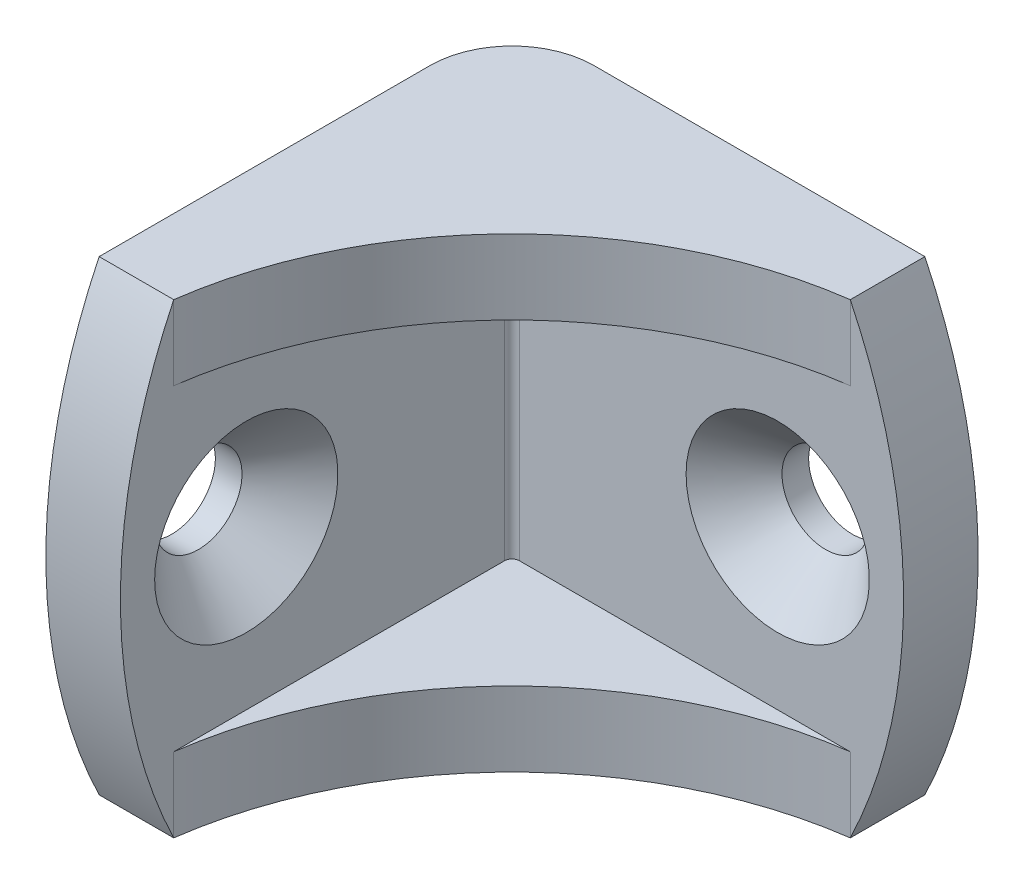
ISO-10303-21;
HEADER;
FILE_DESCRIPTION(('STEP AP214'),'2;1');
FILE_NAME('part.step','',(''),(''),'','','');
FILE_SCHEMA(('AUTOMOTIVE_DESIGN { 1 0 10303 214 1 1 1 1 }'));
ENDSEC;
DATA;
#1=APPLICATION_CONTEXT('core data for automotive mechanical design processes');
#2=APPLICATION_PROTOCOL_DEFINITION('international standard','automotive_design',2000,#1);
#3=PRODUCT_CONTEXT('',#1,'mechanical');
#4=PRODUCT('Part','Part','',(#3));
#5=PRODUCT_RELATED_PRODUCT_CATEGORY('part','',(#4));
#6=PRODUCT_DEFINITION_FORMATION('','',#4);
#7=PRODUCT_DEFINITION_CONTEXT('part definition',#1,'design');
#8=PRODUCT_DEFINITION('design','',#6,#7);
#9=PRODUCT_DEFINITION_SHAPE('','',#8);
#10=(LENGTH_UNIT() NAMED_UNIT(*) SI_UNIT(.MILLI.,.METRE.));
#11=(NAMED_UNIT(*) PLANE_ANGLE_UNIT() SI_UNIT($,.RADIAN.));
#12=(NAMED_UNIT(*) SI_UNIT($,.STERADIAN.) SOLID_ANGLE_UNIT());
#13=UNCERTAINTY_MEASURE_WITH_UNIT(LENGTH_MEASURE(1.E-05),#10,'distance_accuracy_value','');
#14=(GEOMETRIC_REPRESENTATION_CONTEXT(3) GLOBAL_UNCERTAINTY_ASSIGNED_CONTEXT((#13)) GLOBAL_UNIT_ASSIGNED_CONTEXT((#10,
#11,#12)) REPRESENTATION_CONTEXT('',''));
#15=CARTESIAN_POINT('',(0.,0.,0.));
#16=DIRECTION('',(0.,0.,1.));
#17=DIRECTION('',(1.,0.,0.));
#18=AXIS2_PLACEMENT_3D('',#15,#16,#17);
#19=CARTESIAN_POINT('',(3.9116,11.1125,3.556));
#20=DIRECTION('',(0.,0.,-1.));
#21=DIRECTION('',(-1.,0.,0.));
#22=AXIS2_PLACEMENT_3D('',#19,#20,#21);
#23=PLANE('',#22);
#24=CARTESIAN_POINT('',(16.225,0.,3.556));
#25=DIRECTION('',(0.,0.,-1.));
#26=DIRECTION('',(-1.,0.,0.));
#27=AXIS2_PLACEMENT_3D('',#24,#25,#26);
#28=CIRCLE('',#27,4.3688);
#29=CARTESIAN_POINT('',(11.8562,0.,3.556));
#30=VERTEX_POINT('',#29);
#31=EDGE_CURVE('E193',#30,#30,#28,.T.);
#32=ORIENTED_EDGE('',*,*,#31,.T.);
#33=EDGE_LOOP('',(#32));
#34=FACE_BOUND('',#33,.T.);
#35=CARTESIAN_POINT('',(-3.35359375000001,0.,3.556));
#36=DIRECTION('',(0.,0.,-1.));
#37=DIRECTION('',(-1.,0.,0.));
#38=AXIS2_PLACEMENT_3D('',#35,#36,#37);
#39=CIRCLE('',#38,25.57859375);
#40=CARTESIAN_POINT('',(19.685,11.1125,3.55600000000002));
#41=VERTEX_POINT('',#40);
#42=CARTESIAN_POINT('',(19.685,-11.1125,3.556));
#43=VERTEX_POINT('',#42);
#44=EDGE_CURVE('E125',#41,#43,#39,.T.);
#45=ORIENTED_EDGE('',*,*,#44,.F.);
#46=DIRECTION('',(0.,1.,0.));
#47=VECTOR('',#46,1.);
#48=CARTESIAN_POINT('',(19.685,7.5565,3.556));
#49=LINE('',#48,#47);
#50=CARTESIAN_POINT('',(19.685,7.5565,3.556));
#51=VERTEX_POINT('',#50);
#52=EDGE_CURVE('E138',#51,#41,#49,.T.);
#53=ORIENTED_EDGE('',*,*,#52,.F.);
#54=DIRECTION('',(-1.,0.,0.));
#55=VECTOR('',#54,1.);
#56=CARTESIAN_POINT('',(3.9116,7.5565,3.556));
#57=LINE('',#56,#55);
#58=CARTESIAN_POINT('',(3.9116,7.5565,3.556));
#59=VERTEX_POINT('',#58);
#60=EDGE_CURVE('E410',#51,#59,#57,.T.);
#61=ORIENTED_EDGE('',*,*,#60,.T.);
#62=DIRECTION('',(0.,-1.,0.));
#63=VECTOR('',#62,1.);
#64=CARTESIAN_POINT('',(3.9116,11.1125,3.556));
#65=LINE('',#64,#63);
#66=CARTESIAN_POINT('',(3.9116,-7.5565,3.556));
#67=VERTEX_POINT('',#66);
#68=EDGE_CURVE('E173',#59,#67,#65,.T.);
#69=ORIENTED_EDGE('',*,*,#68,.T.);
#70=DIRECTION('',(-1.,0.,0.));
#71=VECTOR('',#70,1.);
#72=CARTESIAN_POINT('',(3.9116,-7.5565,3.556));
#73=LINE('',#72,#71);
#74=CARTESIAN_POINT('',(19.685,-7.5565,3.556));
#75=VERTEX_POINT('',#74);
#76=EDGE_CURVE('E401',#75,#67,#73,.T.);
#77=ORIENTED_EDGE('',*,*,#76,.F.);
#78=DIRECTION('',(0.,-1.,0.));
#79=VECTOR('',#78,1.);
#80=CARTESIAN_POINT('',(19.685,-7.5565,3.556));
#81=LINE('',#80,#79);
#82=EDGE_CURVE('E140',#75,#43,#81,.T.);
#83=ORIENTED_EDGE('',*,*,#82,.T.);
#84=EDGE_LOOP('',(#45,#53,#61,#69,#77,#83));
#85=FACE_BOUND('',#84,.T.);
#86=ADVANCED_FACE('F44',(#34,#85),#23,.F.);
#87=CARTESIAN_POINT('',(3.9116,11.1125,0.));
#88=DIRECTION('',(0.,0.,-1.));
#89=DIRECTION('',(-1.,0.,0.));
#90=AXIS2_PLACEMENT_3D('',#87,#88,#89);
#91=PLANE('',#90);
#92=CARTESIAN_POINT('',(16.225,0.,0.));
#93=DIRECTION('',(0.,0.,-1.));
#94=DIRECTION('',(-1.,0.,0.));
#95=AXIS2_PLACEMENT_3D('',#92,#93,#94);
#96=CIRCLE('',#95,2.0828);
#97=CARTESIAN_POINT('',(14.1422,0.,0.));
#98=VERTEX_POINT('',#97);
#99=EDGE_CURVE('E142',#98,#98,#96,.T.);
#100=ORIENTED_EDGE('',*,*,#99,.F.);
#101=EDGE_LOOP('',(#100));
#102=FACE_BOUND('',#101,.T.);
#103=DIRECTION('',(1.,0.,0.));
#104=VECTOR('',#103,1.);
#105=CARTESIAN_POINT('',(3.9116,11.1125,0.));
#106=LINE('',#105,#104);
#107=CARTESIAN_POINT('',(3.9116,11.1125,0.));
#108=VERTEX_POINT('',#107);
#109=CARTESIAN_POINT('',(19.685,11.1125,0.));
#110=VERTEX_POINT('',#109);
#111=EDGE_CURVE('E165',#108,#110,#106,.T.);
#112=ORIENTED_EDGE('',*,*,#111,.T.);
#113=CARTESIAN_POINT('',(-3.35359374999999,0.,0.));
#114=DIRECTION('',(0.,0.,-1.));
#115=DIRECTION('',(-1.,0.,0.));
#116=AXIS2_PLACEMENT_3D('',#113,#114,#115);
#117=CIRCLE('',#116,25.57859375);
#118=CARTESIAN_POINT('',(19.685,-11.1125,0.));
#119=VERTEX_POINT('',#118);
#120=EDGE_CURVE('E127',#110,#119,#117,.T.);
#121=ORIENTED_EDGE('',*,*,#120,.T.);
#122=DIRECTION('',(1.,0.,0.));
#123=VECTOR('',#122,1.);
#124=CARTESIAN_POINT('',(3.9116,-11.1125,0.));
#125=LINE('',#124,#123);
#126=CARTESIAN_POINT('',(3.9116,-11.1125,0.));
#127=VERTEX_POINT('',#126);
#128=EDGE_CURVE('E159',#127,#119,#125,.T.);
#129=ORIENTED_EDGE('',*,*,#128,.F.);
#130=DIRECTION('',(0.,-1.,0.));
#131=VECTOR('',#130,1.);
#132=CARTESIAN_POINT('',(3.9116,11.1125,0.));
#133=LINE('',#132,#131);
#134=EDGE_CURVE('E188',#108,#127,#133,.T.);
#135=ORIENTED_EDGE('',*,*,#134,.F.);
#136=EDGE_LOOP('',(#112,#121,#129,#135));
#137=FACE_BOUND('',#136,.T.);
#138=ADVANCED_FACE('F213',(#102,#137),#91,.T.);
#139=CARTESIAN_POINT('',(3.9116,11.1125,3.9116));
#140=DIRECTION('',(0.,-1.,0.));
#141=DIRECTION('',(-1.,0.,0.));
#142=AXIS2_PLACEMENT_3D('',#139,#140,#141);
#143=PLANE('',#142);
#144=DIRECTION('',(0.,0.,-1.));
#145=VECTOR('',#144,1.);
#146=CARTESIAN_POINT('',(19.6849999999998,11.1125,51.6745364977729));
#147=LINE('',#146,#145);
#148=EDGE_CURVE('E121',#41,#110,#147,.T.);
#149=ORIENTED_EDGE('',*,*,#148,.T.);
#150=ORIENTED_EDGE('',*,*,#111,.F.);
#151=CARTESIAN_POINT('',(3.9116,11.1125,3.9116));
#152=DIRECTION('',(0.,-1.,0.));
#153=DIRECTION('',(0.,0.,1.));
#154=AXIS2_PLACEMENT_3D('',#151,#152,#153);
#155=CIRCLE('',#154,3.9116);
#156=CARTESIAN_POINT('',(0.,11.1125,3.9116));
#157=VERTEX_POINT('',#156);
#158=EDGE_CURVE('E167',#157,#108,#155,.T.);
#159=ORIENTED_EDGE('',*,*,#158,.F.);
#160=DIRECTION('',(0.,0.,-1.));
#161=VECTOR('',#160,1.);
#162=CARTESIAN_POINT('',(0.,11.1125,22.225));
#163=LINE('',#162,#161);
#164=CARTESIAN_POINT('',(0.,11.1125,19.685));
#165=VERTEX_POINT('',#164);
#166=EDGE_CURVE('E171',#165,#157,#163,.T.);
#167=ORIENTED_EDGE('',*,*,#166,.F.);
#168=DIRECTION('',(-1.,0.,0.));
#169=VECTOR('',#168,1.);
#170=CARTESIAN_POINT('',(51.6745364977729,11.1125,19.685));
#171=LINE('',#170,#169);
#172=CARTESIAN_POINT('',(3.556,11.1125,19.685));
#173=VERTEX_POINT('',#172);
#174=EDGE_CURVE('E148',#173,#165,#171,.T.);
#175=ORIENTED_EDGE('',*,*,#174,.F.);
#176=CARTESIAN_POINT('',(22.225,11.1125,22.225));
#177=DIRECTION('',(0.,-1.,0.));
#178=DIRECTION('',(0.,0.,-1.));
#179=AXIS2_PLACEMENT_3D('',#176,#177,#178);
#180=CIRCLE('',#179,18.8409968154554);
#181=EDGE_CURVE('E145',#173,#41,#180,.T.);
#182=ORIENTED_EDGE('',*,*,#181,.T.);
#183=EDGE_LOOP('',(#149,#150,#159,#167,#175,#182));
#184=FACE_BOUND('',#183,.T.);
#185=ADVANCED_FACE('F146',(#184),#143,.F.);
#186=CARTESIAN_POINT('',(3.9116,-11.1125,3.9116));
#187=DIRECTION('',(0.,-1.,0.));
#188=DIRECTION('',(-1.,0.,0.));
#189=AXIS2_PLACEMENT_3D('',#186,#187,#188);
#190=PLANE('',#189);
#191=ORIENTED_EDGE('',*,*,#128,.T.);
#192=DIRECTION('',(0.,0.,-1.));
#193=VECTOR('',#192,1.);
#194=CARTESIAN_POINT('',(19.6849999999998,-11.1125,51.6745364977729));
#195=LINE('',#194,#193);
#196=EDGE_CURVE('E191',#119,#43,#195,.F.);
#197=ORIENTED_EDGE('',*,*,#196,.T.);
#198=CARTESIAN_POINT('',(22.225,-11.1125,22.225));
#199=DIRECTION('',(0.,-1.,0.));
#200=DIRECTION('',(0.,0.,-1.));
#201=AXIS2_PLACEMENT_3D('',#198,#199,#200);
#202=CIRCLE('',#201,18.8409968154554);
#203=CARTESIAN_POINT('',(3.556,-11.1125,19.685));
#204=VERTEX_POINT('',#203);
#205=EDGE_CURVE('E391',#204,#43,#202,.T.);
#206=ORIENTED_EDGE('',*,*,#205,.F.);
#207=DIRECTION('',(-1.,0.,0.));
#208=VECTOR('',#207,1.);
#209=CARTESIAN_POINT('',(51.6745364977729,-11.1125,19.685));
#210=LINE('',#209,#208);
#211=CARTESIAN_POINT('',(0.,-11.1125,19.685));
#212=VERTEX_POINT('',#211);
#213=EDGE_CURVE('E67',#212,#204,#210,.F.);
#214=ORIENTED_EDGE('',*,*,#213,.F.);
#215=DIRECTION('',(0.,0.,-1.));
#216=VECTOR('',#215,1.);
#217=CARTESIAN_POINT('',(0.,-11.1125,22.225));
#218=LINE('',#217,#216);
#219=CARTESIAN_POINT('',(0.,-11.1125,3.9116));
#220=VERTEX_POINT('',#219);
#221=EDGE_CURVE('E168',#212,#220,#218,.T.);
#222=ORIENTED_EDGE('',*,*,#221,.T.);
#223=CARTESIAN_POINT('',(3.9116,-11.1125,3.9116));
#224=DIRECTION('',(0.,-1.,0.));
#225=DIRECTION('',(0.,0.,1.));
#226=AXIS2_PLACEMENT_3D('',#223,#224,#225);
#227=CIRCLE('',#226,3.9116);
#228=EDGE_CURVE('E176',#220,#127,#227,.T.);
#229=ORIENTED_EDGE('',*,*,#228,.T.);
#230=EDGE_LOOP('',(#191,#197,#206,#214,#222,#229));
#231=FACE_BOUND('',#230,.T.);
#232=ADVANCED_FACE('F233',(#231),#190,.T.);
#233=CARTESIAN_POINT('',(3.556,11.1125,22.225));
#234=DIRECTION('',(-1.,0.,0.));
#235=DIRECTION('',(0.,0.,1.));
#236=AXIS2_PLACEMENT_3D('',#233,#234,#235);
#237=PLANE('',#236);
#238=CARTESIAN_POINT('',(3.556,0.,16.225));
#239=DIRECTION('',(-1.,0.,0.));
#240=DIRECTION('',(0.,0.,1.));
#241=AXIS2_PLACEMENT_3D('',#238,#239,#240);
#242=CIRCLE('',#241,4.3688);
#243=CARTESIAN_POINT('',(3.556,0.,20.5938));
#244=VERTEX_POINT('',#243);
#245=EDGE_CURVE('E13',#244,#244,#242,.T.);
#246=ORIENTED_EDGE('',*,*,#245,.T.);
#247=EDGE_LOOP('',(#246));
#248=FACE_BOUND('',#247,.T.);
#249=CARTESIAN_POINT('',(3.556,0.,-3.35359374999999));
#250=DIRECTION('',(-1.,0.,0.));
#251=DIRECTION('',(0.,0.,1.));
#252=AXIS2_PLACEMENT_3D('',#249,#250,#251);
#253=CIRCLE('',#252,25.57859375);
#254=EDGE_CURVE('E382',#173,#204,#253,.F.);
#255=ORIENTED_EDGE('',*,*,#254,.T.);
#256=DIRECTION('',(0.,-1.,0.));
#257=VECTOR('',#256,1.);
#258=CARTESIAN_POINT('',(3.556,-7.5565,19.685));
#259=LINE('',#258,#257);
#260=CARTESIAN_POINT('',(3.556,-7.5565,19.685));
#261=VERTEX_POINT('',#260);
#262=EDGE_CURVE('E404',#261,#204,#259,.T.);
#263=ORIENTED_EDGE('',*,*,#262,.F.);
#264=DIRECTION('',(0.,0.,1.));
#265=VECTOR('',#264,1.);
#266=CARTESIAN_POINT('',(3.556,-7.5565,19.685));
#267=LINE('',#266,#265);
#268=CARTESIAN_POINT('',(3.556,-7.5565,3.9116));
#269=VERTEX_POINT('',#268);
#270=EDGE_CURVE('E395',#269,#261,#267,.T.);
#271=ORIENTED_EDGE('',*,*,#270,.F.);
#272=DIRECTION('',(0.,-1.,0.));
#273=VECTOR('',#272,1.);
#274=CARTESIAN_POINT('',(3.556,11.1125,3.9116));
#275=LINE('',#274,#273);
#276=CARTESIAN_POINT('',(3.556,7.5565,3.9116));
#277=VERTEX_POINT('',#276);
#278=EDGE_CURVE('E182',#277,#269,#275,.T.);
#279=ORIENTED_EDGE('',*,*,#278,.F.);
#280=DIRECTION('',(0.,0.,1.));
#281=VECTOR('',#280,1.);
#282=CARTESIAN_POINT('',(3.556,7.5565,19.685));
#283=LINE('',#282,#281);
#284=CARTESIAN_POINT('',(3.556,7.5565,19.685));
#285=VERTEX_POINT('',#284);
#286=EDGE_CURVE('E157',#277,#285,#283,.T.);
#287=ORIENTED_EDGE('',*,*,#286,.T.);
#288=DIRECTION('',(0.,1.,0.));
#289=VECTOR('',#288,1.);
#290=CARTESIAN_POINT('',(3.556,7.5565,19.685));
#291=LINE('',#290,#289);
#292=EDGE_CURVE('E156',#285,#173,#291,.T.);
#293=ORIENTED_EDGE('',*,*,#292,.T.);
#294=EDGE_LOOP('',(#255,#263,#271,#279,#287,#293));
#295=FACE_BOUND('',#294,.T.);
#296=ADVANCED_FACE('F230',(#248,#295),#237,.F.);
#297=CARTESIAN_POINT('',(0.,11.1125,22.225));
#298=DIRECTION('',(-1.,0.,0.));
#299=DIRECTION('',(0.,0.,1.));
#300=AXIS2_PLACEMENT_3D('',#297,#298,#299);
#301=PLANE('',#300);
#302=CARTESIAN_POINT('',(0.,0.,-3.35359374999999));
#303=DIRECTION('',(-1.,0.,0.));
#304=DIRECTION('',(0.,0.,1.));
#305=AXIS2_PLACEMENT_3D('',#302,#303,#304);
#306=CIRCLE('',#305,25.57859375);
#307=EDGE_CURVE('E59',#165,#212,#306,.F.);
#308=ORIENTED_EDGE('',*,*,#307,.F.);
#309=ORIENTED_EDGE('',*,*,#166,.T.);
#310=DIRECTION('',(0.,-1.,0.));
#311=VECTOR('',#310,1.);
#312=CARTESIAN_POINT('',(0.,11.1125,3.9116));
#313=LINE('',#312,#311);
#314=EDGE_CURVE('E185',#157,#220,#313,.T.);
#315=ORIENTED_EDGE('',*,*,#314,.T.);
#316=ORIENTED_EDGE('',*,*,#221,.F.);
#317=EDGE_LOOP('',(#308,#309,#315,#316));
#318=FACE_BOUND('',#317,.T.);
#319=CARTESIAN_POINT('',(0.,0.,16.225));
#320=DIRECTION('',(1.,0.,0.));
#321=DIRECTION('',(0.,0.,-1.));
#322=AXIS2_PLACEMENT_3D('',#319,#320,#321);
#323=CIRCLE('',#322,2.0828);
#324=CARTESIAN_POINT('',(0.,0.,14.1422));
#325=VERTEX_POINT('',#324);
#326=EDGE_CURVE('E387',#325,#325,#323,.T.);
#327=ORIENTED_EDGE('',*,*,#326,.T.);
#328=EDGE_LOOP('',(#327));
#329=FACE_BOUND('',#328,.T.);
#330=ADVANCED_FACE('F226',(#318,#329),#301,.T.);
#331=CARTESIAN_POINT('',(3.9116,11.1125,3.9116));
#332=DIRECTION('',(0.,-1.,0.));
#333=DIRECTION('',(0.,0.,-1.));
#334=AXIS2_PLACEMENT_3D('',#331,#332,#333);
#335=CYLINDRICAL_SURFACE('',#334,3.9116);
#336=ORIENTED_EDGE('',*,*,#228,.F.);
#337=ORIENTED_EDGE('',*,*,#314,.F.);
#338=ORIENTED_EDGE('',*,*,#158,.T.);
#339=ORIENTED_EDGE('',*,*,#134,.T.);
#340=EDGE_LOOP('',(#336,#337,#338,#339));
#341=FACE_BOUND('',#340,.T.);
#342=ADVANCED_FACE('F222',(#341),#335,.T.);
#343=CARTESIAN_POINT('',(3.9116,11.1125,3.9116));
#344=DIRECTION('',(0.,-1.,0.));
#345=DIRECTION('',(0.,0.,-1.));
#346=AXIS2_PLACEMENT_3D('',#343,#344,#345);
#347=CYLINDRICAL_SURFACE('',#346,0.3556);
#348=ORIENTED_EDGE('',*,*,#278,.T.);
#349=CARTESIAN_POINT('',(3.9116,-7.5565,3.9116));
#350=DIRECTION('',(0.,1.,0.));
#351=DIRECTION('',(0.,0.,1.));
#352=AXIS2_PLACEMENT_3D('',#349,#350,#351);
#353=CIRCLE('',#352,0.3556);
#354=EDGE_CURVE('E398',#67,#269,#353,.T.);
#355=ORIENTED_EDGE('',*,*,#354,.F.);
#356=ORIENTED_EDGE('',*,*,#68,.F.);
#357=CARTESIAN_POINT('',(3.9116,7.5565,3.9116));
#358=DIRECTION('',(0.,1.,0.));
#359=DIRECTION('',(0.,0.,1.));
#360=AXIS2_PLACEMENT_3D('',#357,#358,#359);
#361=CIRCLE('',#360,0.3556);
#362=EDGE_CURVE('E162',#59,#277,#361,.T.);
#363=ORIENTED_EDGE('',*,*,#362,.T.);
#364=EDGE_LOOP('',(#348,#355,#356,#363));
#365=FACE_BOUND('',#364,.T.);
#366=ADVANCED_FACE('F225',(#365),#347,.F.);
#367=CARTESIAN_POINT('',(22.225,7.5565,22.225));
#368=DIRECTION('',(0.,1.,0.));
#369=DIRECTION('',(0.,0.,1.));
#370=AXIS2_PLACEMENT_3D('',#367,#368,#369);
#371=CYLINDRICAL_SURFACE('',#370,18.8409968154554);
#372=ORIENTED_EDGE('',*,*,#181,.F.);
#373=ORIENTED_EDGE('',*,*,#292,.F.);
#374=CARTESIAN_POINT('',(22.225,7.5565,22.225));
#375=DIRECTION('',(0.,-1.,0.));
#376=DIRECTION('',(0.,0.,-1.));
#377=AXIS2_PLACEMENT_3D('',#374,#375,#376);
#378=CIRCLE('',#377,18.8409968154554);
#379=EDGE_CURVE('E151',#285,#51,#378,.T.);
#380=ORIENTED_EDGE('',*,*,#379,.T.);
#381=ORIENTED_EDGE('',*,*,#52,.T.);
#382=EDGE_LOOP('',(#372,#373,#380,#381));
#383=FACE_BOUND('',#382,.T.);
#384=ADVANCED_FACE('F154',(#383),#371,.F.);
#385=CARTESIAN_POINT('',(22.225,7.5565,22.225));
#386=DIRECTION('',(0.,-1.,0.));
#387=DIRECTION('',(0.,0.,-1.));
#388=AXIS2_PLACEMENT_3D('',#385,#386,#387);
#389=PLANE('',#388);
#390=ORIENTED_EDGE('',*,*,#379,.F.);
#391=ORIENTED_EDGE('',*,*,#286,.F.);
#392=ORIENTED_EDGE('',*,*,#362,.F.);
#393=ORIENTED_EDGE('',*,*,#60,.F.);
#394=EDGE_LOOP('',(#390,#391,#392,#393));
#395=FACE_BOUND('',#394,.T.);
#396=ADVANCED_FACE('F244',(#395),#389,.T.);
#397=CARTESIAN_POINT('',(22.225,-7.5565,22.225));
#398=DIRECTION('',(0.,-1.,0.));
#399=DIRECTION('',(0.,0.,-1.));
#400=AXIS2_PLACEMENT_3D('',#397,#398,#399);
#401=CYLINDRICAL_SURFACE('',#400,18.8409968154554);
#402=ORIENTED_EDGE('',*,*,#205,.T.);
#403=ORIENTED_EDGE('',*,*,#82,.F.);
#404=CARTESIAN_POINT('',(22.225,-7.5565,22.225));
#405=DIRECTION('',(0.,-1.,0.));
#406=DIRECTION('',(0.,0.,-1.));
#407=AXIS2_PLACEMENT_3D('',#404,#405,#406);
#408=CIRCLE('',#407,18.8409968154554);
#409=EDGE_CURVE('E392',#261,#75,#408,.T.);
#410=ORIENTED_EDGE('',*,*,#409,.F.);
#411=ORIENTED_EDGE('',*,*,#262,.T.);
#412=EDGE_LOOP('',(#402,#403,#410,#411));
#413=FACE_BOUND('',#412,.T.);
#414=ADVANCED_FACE('F247',(#413),#401,.F.);
#415=CARTESIAN_POINT('',(22.225,-7.5565,22.225));
#416=DIRECTION('',(0.,1.,0.));
#417=DIRECTION('',(0.,0.,-1.));
#418=AXIS2_PLACEMENT_3D('',#415,#416,#417);
#419=PLANE('',#418);
#420=ORIENTED_EDGE('',*,*,#409,.T.);
#421=ORIENTED_EDGE('',*,*,#76,.T.);
#422=ORIENTED_EDGE('',*,*,#354,.T.);
#423=ORIENTED_EDGE('',*,*,#270,.T.);
#424=EDGE_LOOP('',(#420,#421,#422,#423));
#425=FACE_BOUND('',#424,.T.);
#426=ADVANCED_FACE('F251',(#425),#419,.T.);
#427=CARTESIAN_POINT('',(22.225,0.,16.225));
#428=DIRECTION('',(-1.,0.,0.));
#429=DIRECTION('',(0.,0.,1.));
#430=AXIS2_PLACEMENT_3D('',#427,#428,#429);
#431=CYLINDRICAL_SURFACE('',#430,2.0828);
#432=CARTESIAN_POINT('',(1.27000000000001,0.,16.225));
#433=DIRECTION('',(-1.,0.,0.));
#434=DIRECTION('',(0.,0.,1.));
#435=AXIS2_PLACEMENT_3D('',#432,#433,#434);
#436=CIRCLE('',#435,2.0828);
#437=CARTESIAN_POINT('',(1.27000000000001,0.,18.3078));
#438=VERTEX_POINT('',#437);
#439=EDGE_CURVE('E52',#438,#438,#436,.F.);
#440=ORIENTED_EDGE('',*,*,#439,.T.);
#441=EDGE_LOOP('',(#440));
#442=FACE_BOUND('',#441,.T.);
#443=ORIENTED_EDGE('',*,*,#326,.F.);
#444=EDGE_LOOP('',(#443));
#445=FACE_BOUND('',#444,.T.);
#446=ADVANCED_FACE('F201',(#442,#445),#431,.F.);
#447=CARTESIAN_POINT('',(51.6745364977729,0.,-3.35359374999999));
#448=DIRECTION('',(-1.,0.,0.));
#449=DIRECTION('',(0.,0.,1.));
#450=AXIS2_PLACEMENT_3D('',#447,#448,#449);
#451=CYLINDRICAL_SURFACE('',#450,25.57859375);
#452=ORIENTED_EDGE('',*,*,#213,.T.);
#453=ORIENTED_EDGE('',*,*,#254,.F.);
#454=ORIENTED_EDGE('',*,*,#174,.T.);
#455=ORIENTED_EDGE('',*,*,#307,.T.);
#456=EDGE_LOOP('',(#452,#453,#454,#455));
#457=FACE_BOUND('',#456,.T.);
#458=ADVANCED_FACE('F258',(#457),#451,.T.);
#459=CARTESIAN_POINT('',(16.2249999999999,0.,22.2250000000001));
#460=DIRECTION('',(0.,0.,-1.));
#461=DIRECTION('',(-1.,0.,0.));
#462=AXIS2_PLACEMENT_3D('',#459,#460,#461);
#463=CYLINDRICAL_SURFACE('',#462,2.0828);
#464=CARTESIAN_POINT('',(16.225,0.,1.26999999999999));
#465=DIRECTION('',(0.,0.,-1.));
#466=DIRECTION('',(-1.,0.,0.));
#467=AXIS2_PLACEMENT_3D('',#464,#465,#466);
#468=CIRCLE('',#467,2.0828);
#469=CARTESIAN_POINT('',(14.1422,0.,1.26999999999998));
#470=VERTEX_POINT('',#469);
#471=EDGE_CURVE('E196',#470,#470,#468,.F.);
#472=ORIENTED_EDGE('',*,*,#471,.T.);
#473=EDGE_LOOP('',(#472));
#474=FACE_BOUND('',#473,.T.);
#475=ORIENTED_EDGE('',*,*,#99,.T.);
#476=EDGE_LOOP('',(#475));
#477=FACE_BOUND('',#476,.T.);
#478=ADVANCED_FACE('F261',(#474,#477),#463,.F.);
#479=CARTESIAN_POINT('',(-3.35359375000018,0.,51.6745364977729));
#480=DIRECTION('',(0.,0.,-1.));
#481=DIRECTION('',(-1.,0.,0.));
#482=AXIS2_PLACEMENT_3D('',#479,#480,#481);
#483=CYLINDRICAL_SURFACE('',#482,25.57859375);
#484=ORIENTED_EDGE('',*,*,#148,.F.);
#485=ORIENTED_EDGE('',*,*,#44,.T.);
#486=ORIENTED_EDGE('',*,*,#196,.F.);
#487=ORIENTED_EDGE('',*,*,#120,.F.);
#488=EDGE_LOOP('',(#484,#485,#486,#487));
#489=FACE_BOUND('',#488,.T.);
#490=ADVANCED_FACE('F123',(#489),#483,.T.);
#491=CARTESIAN_POINT('',(16.225,0.,3.556));
#492=DIRECTION('',(0.,0.,1.));
#493=DIRECTION('',(1.,0.,0.));
#494=AXIS2_PLACEMENT_3D('',#491,#492,#493);
#495=CONICAL_SURFACE('',#494,4.36879999999999,0.785398163397445);
#496=ORIENTED_EDGE('',*,*,#471,.F.);
#497=EDGE_LOOP('',(#496));
#498=FACE_BOUND('',#497,.T.);
#499=ORIENTED_EDGE('',*,*,#31,.F.);
#500=EDGE_LOOP('',(#499));
#501=FACE_BOUND('',#500,.T.);
#502=ADVANCED_FACE('F205',(#498,#501),#495,.F.);
#503=CARTESIAN_POINT('',(1.27000000000001,0.,16.225));
#504=DIRECTION('',(1.,0.,0.));
#505=DIRECTION('',(0.,0.,-1.));
#506=AXIS2_PLACEMENT_3D('',#503,#504,#505);
#507=CONICAL_SURFACE('',#506,2.0828,0.785398163397451);
#508=ORIENTED_EDGE('',*,*,#245,.F.);
#509=EDGE_LOOP('',(#508));
#510=FACE_BOUND('',#509,.T.);
#511=ORIENTED_EDGE('',*,*,#439,.F.);
#512=EDGE_LOOP('',(#511));
#513=FACE_BOUND('',#512,.T.);
#514=ADVANCED_FACE('F46',(#510,#513),#507,.F.);
#515=CLOSED_SHELL('',(#86,#138,#185,#232,#296,#330,#342,#366,#384,#396,#414,#426,#446,#458,#478,
#490,#502,#514));
#516=MANIFOLD_SOLID_BREP('B2',#515);
#517=ADVANCED_BREP_SHAPE_REPRESENTATION('',(#18,#516),#14);
#518=SHAPE_DEFINITION_REPRESENTATION(#9,#517);
ENDSEC;
END-ISO-10303-21;
